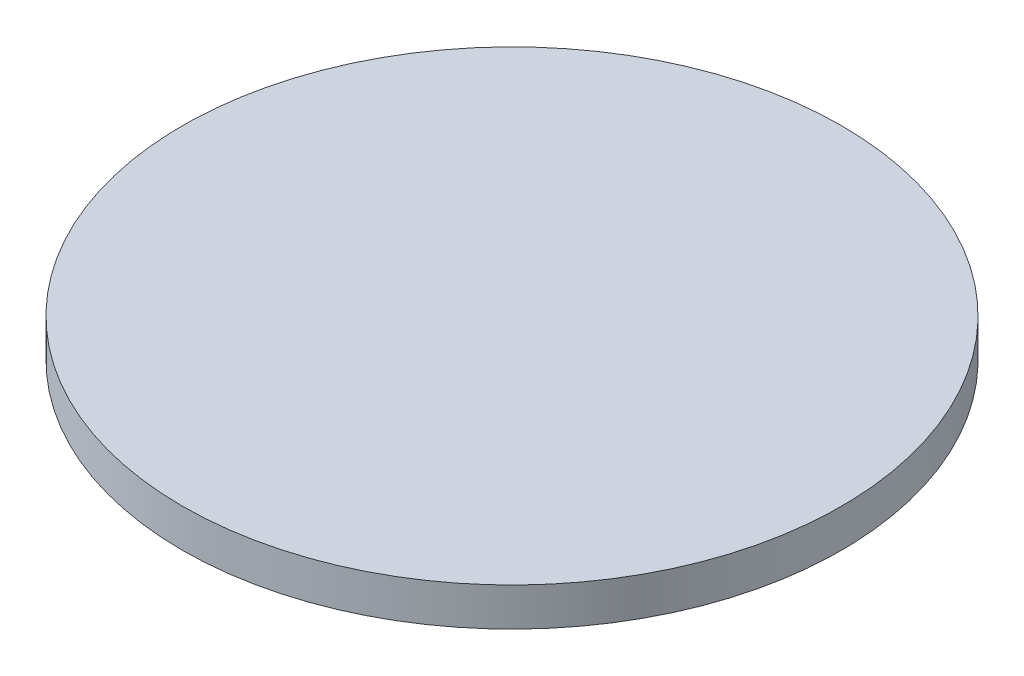
ISO-10303-21;
HEADER;
FILE_DESCRIPTION(('STEP AP214'),'2;1');
FILE_NAME('part.step','',(''),(''),'','','');
FILE_SCHEMA(('AUTOMOTIVE_DESIGN { 1 0 10303 214 1 1 1 1 }'));
ENDSEC;
DATA;
#1=APPLICATION_CONTEXT('core data for automotive mechanical design processes');
#2=APPLICATION_PROTOCOL_DEFINITION('international standard','automotive_design',2000,#1);
#3=PRODUCT_CONTEXT('',#1,'mechanical');
#4=PRODUCT('Part','Part','',(#3));
#5=PRODUCT_RELATED_PRODUCT_CATEGORY('part','',(#4));
#6=PRODUCT_DEFINITION_FORMATION('','',#4);
#7=PRODUCT_DEFINITION_CONTEXT('part definition',#1,'design');
#8=PRODUCT_DEFINITION('design','',#6,#7);
#9=PRODUCT_DEFINITION_SHAPE('','',#8);
#10=(LENGTH_UNIT() NAMED_UNIT(*) SI_UNIT(.MILLI.,.METRE.));
#11=(NAMED_UNIT(*) PLANE_ANGLE_UNIT() SI_UNIT($,.RADIAN.));
#12=(NAMED_UNIT(*) SI_UNIT($,.STERADIAN.) SOLID_ANGLE_UNIT());
#13=UNCERTAINTY_MEASURE_WITH_UNIT(LENGTH_MEASURE(1.E-05),#10,'distance_accuracy_value','');
#14=(GEOMETRIC_REPRESENTATION_CONTEXT(3) GLOBAL_UNCERTAINTY_ASSIGNED_CONTEXT((#13)) GLOBAL_UNIT_ASSIGNED_CONTEXT((#10,
#11,#12)) REPRESENTATION_CONTEXT('',''));
#15=CARTESIAN_POINT('',(0.,0.,0.));
#16=DIRECTION('',(0.,0.,1.));
#17=DIRECTION('',(1.,0.,0.));
#18=AXIS2_PLACEMENT_3D('',#15,#16,#17);
#19=CARTESIAN_POINT('',(0.,12.7,0.));
#20=DIRECTION('',(0.,-1.,0.));
#21=DIRECTION('',(0.,0.,-1.));
#22=AXIS2_PLACEMENT_3D('',#19,#20,#21);
#23=CYLINDRICAL_SURFACE('',#22,109.5375);
#24=CARTESIAN_POINT('',(0.,12.7,0.));
#25=DIRECTION('',(0.,1.,0.));
#26=DIRECTION('',(0.,0.,1.));
#27=AXIS2_PLACEMENT_3D('',#24,#25,#26);
#28=CIRCLE('',#27,109.5375);
#29=CARTESIAN_POINT('',(0.,12.7,109.5375));
#30=VERTEX_POINT('',#29);
#31=EDGE_CURVE('E10',#30,#30,#28,.T.);
#32=ORIENTED_EDGE('',*,*,#31,.F.);
#33=EDGE_LOOP('',(#32));
#34=FACE_BOUND('',#33,.T.);
#35=CARTESIAN_POINT('',(0.,0.,0.));
#36=DIRECTION('',(0.,1.,0.));
#37=DIRECTION('',(0.,0.,1.));
#38=AXIS2_PLACEMENT_3D('',#35,#36,#37);
#39=CIRCLE('',#38,109.5375);
#40=CARTESIAN_POINT('',(0.,0.,109.5375));
#41=VERTEX_POINT('',#40);
#42=EDGE_CURVE('E31',#41,#41,#39,.T.);
#43=ORIENTED_EDGE('',*,*,#42,.T.);
#44=EDGE_LOOP('',(#43));
#45=FACE_BOUND('',#44,.T.);
#46=ADVANCED_FACE('F28',(#34,#45),#23,.T.);
#47=CARTESIAN_POINT('',(0.,12.7,0.));
#48=DIRECTION('',(0.,1.,0.));
#49=DIRECTION('',(0.,0.,1.));
#50=AXIS2_PLACEMENT_3D('',#47,#48,#49);
#51=PLANE('',#50);
#52=ORIENTED_EDGE('',*,*,#31,.T.);
#53=EDGE_LOOP('',(#52));
#54=FACE_BOUND('',#53,.T.);
#55=ADVANCED_FACE('F43',(#54),#51,.T.);
#56=CARTESIAN_POINT('',(0.,0.,0.));
#57=DIRECTION('',(0.,1.,0.));
#58=DIRECTION('',(0.,0.,1.));
#59=AXIS2_PLACEMENT_3D('',#56,#57,#58);
#60=PLANE('',#59);
#61=ORIENTED_EDGE('',*,*,#42,.F.);
#62=EDGE_LOOP('',(#61));
#63=FACE_BOUND('',#62,.T.);
#64=ADVANCED_FACE('F41',(#63),#60,.F.);
#65=CLOSED_SHELL('',(#46,#55,#64));
#66=MANIFOLD_SOLID_BREP('B2',#65);
#67=ADVANCED_BREP_SHAPE_REPRESENTATION('',(#18,#66),#14);
#68=SHAPE_DEFINITION_REPRESENTATION(#9,#67);
ENDSEC;
END-ISO-10303-21;
